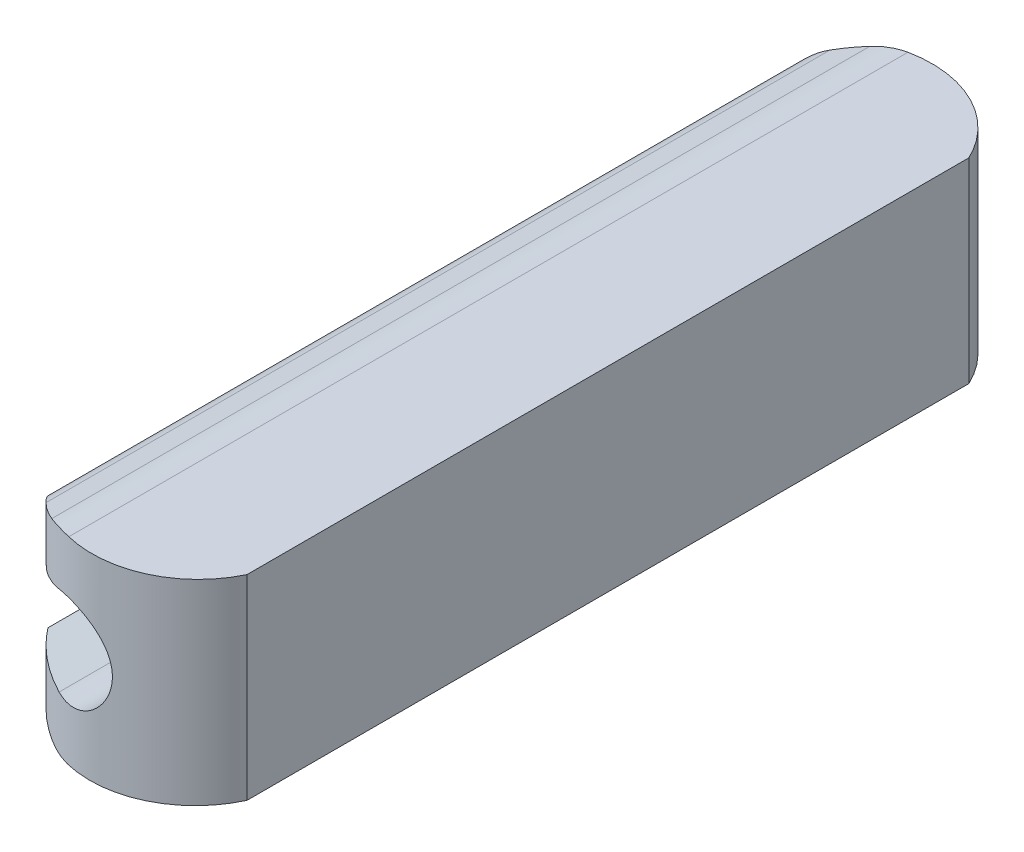
ISO-10303-21;
HEADER;
FILE_DESCRIPTION(('STEP AP214'),'2;1');
FILE_NAME('part.step','',(''),(''),'','','');
FILE_SCHEMA(('AUTOMOTIVE_DESIGN { 1 0 10303 214 1 1 1 1 }'));
ENDSEC;
DATA;
#1=APPLICATION_CONTEXT('core data for automotive mechanical design processes');
#2=APPLICATION_PROTOCOL_DEFINITION('international standard','automotive_design',2000,#1);
#3=PRODUCT_CONTEXT('',#1,'mechanical');
#4=PRODUCT('Part','Part','',(#3));
#5=PRODUCT_RELATED_PRODUCT_CATEGORY('part','',(#4));
#6=PRODUCT_DEFINITION_FORMATION('','',#4);
#7=PRODUCT_DEFINITION_CONTEXT('part definition',#1,'design');
#8=PRODUCT_DEFINITION('design','',#6,#7);
#9=PRODUCT_DEFINITION_SHAPE('','',#8);
#10=(LENGTH_UNIT() NAMED_UNIT(*) SI_UNIT(.MILLI.,.METRE.));
#11=(NAMED_UNIT(*) PLANE_ANGLE_UNIT() SI_UNIT($,.RADIAN.));
#12=(NAMED_UNIT(*) SI_UNIT($,.STERADIAN.) SOLID_ANGLE_UNIT());
#13=UNCERTAINTY_MEASURE_WITH_UNIT(LENGTH_MEASURE(1.E-05),#10,'distance_accuracy_value','');
#14=(GEOMETRIC_REPRESENTATION_CONTEXT(3) GLOBAL_UNCERTAINTY_ASSIGNED_CONTEXT((#13)) GLOBAL_UNIT_ASSIGNED_CONTEXT((#10,
#11,#12)) REPRESENTATION_CONTEXT('',''));
#15=CARTESIAN_POINT('',(0.,0.,0.));
#16=DIRECTION('',(0.,0.,1.));
#17=DIRECTION('',(1.,0.,0.));
#18=AXIS2_PLACEMENT_3D('',#15,#16,#17);
#19=CARTESIAN_POINT('',(-2.45293322950602,-1.69036477014939,16.));
#20=DIRECTION('',(-0.258821432514505,-0.965925186580793,0.));
#21=DIRECTION('',(0.965925186580793,-0.258821432514505,0.));
#22=AXIS2_PLACEMENT_3D('',#19,#20,#21);
#23=PLANE('',#22);
#24=DIRECTION('',(0.,0.,-1.));
#25=VECTOR('',#24,1.);
#26=CARTESIAN_POINT('',(-2.45293322950602,-1.69036477014939,16.));
#27=LINE('',#26,#25);
#28=CARTESIAN_POINT('',(-2.45293322950602,-1.69036477014939,15.7388461950632));
#29=VERTEX_POINT('',#28);
#30=CARTESIAN_POINT('',(-2.45293322950602,-1.69036477014939,-15.7388461950631));
#31=VERTEX_POINT('',#30);
#32=EDGE_CURVE('E177',#29,#31,#27,.T.);
#33=ORIENTED_EDGE('',*,*,#32,.T.);
#34=CARTESIAN_POINT('',(-1.030884728903,-2.07140528461618,-11.9977162722063));
#35=DIRECTION('',(-0.258821432514505,-0.965925186580793,0.));
#36=DIRECTION('',(-0.965925186580793,0.258821432514505,0.));
#37=AXIS2_PLACEMENT_3D('',#34,#35,#36);
#38=ELLIPSE('',#37,4.14347175474436,4.00228372779369);
#39=CARTESIAN_POINT('',(-4.28299140657226,-1.19999731151645,-14.3305422826111));
#40=VERTEX_POINT('',#39);
#41=EDGE_CURVE('E280',#31,#40,#38,.F.);
#42=ORIENTED_EDGE('',*,*,#41,.T.);
#43=DIRECTION('',(0.,0.,-1.));
#44=VECTOR('',#43,1.);
#45=CARTESIAN_POINT('',(-4.28299140657226,-1.19999731151645,16.));
#46=LINE('',#45,#44);
#47=CARTESIAN_POINT('',(-4.28299140657226,-1.19999731151645,14.3305422826111));
#48=VERTEX_POINT('',#47);
#49=EDGE_CURVE('E197',#48,#40,#46,.T.);
#50=ORIENTED_EDGE('',*,*,#49,.F.);
#51=CARTESIAN_POINT('',(-1.030884728903,-2.07140528461618,11.9977162722063));
#52=DIRECTION('',(-0.258821432514505,-0.965925186580793,0.));
#53=DIRECTION('',(-0.965925186580793,0.258821432514505,0.));
#54=AXIS2_PLACEMENT_3D('',#51,#52,#53);
#55=ELLIPSE('',#54,4.14347175474436,4.00228372779369);
#56=EDGE_CURVE('E327',#48,#29,#55,.F.);
#57=ORIENTED_EDGE('',*,*,#56,.T.);
#58=EDGE_LOOP('',(#33,#42,#50,#57));
#59=FACE_BOUND('',#58,.T.);
#60=ADVANCED_FACE('F45',(#59),#23,.F.);
#61=CARTESIAN_POINT('',(-4.80063427160127,-3.13184768467804,16.));
#62=DIRECTION('',(-0.965925186580793,0.258821432514504,0.));
#63=DIRECTION('',(-0.258821432514505,-0.965925186580793,0.));
#64=AXIS2_PLACEMENT_3D('',#61,#62,#63);
#65=PLANE('',#64);
#66=CARTESIAN_POINT('',(-1.030884728903,10.9369100492458,-11.9977162722063));
#67=DIRECTION('',(-0.965925186580793,0.258821432514504,0.));
#68=DIRECTION('',(0.258821432514505,0.965925186580793,0.));
#69=AXIS2_PLACEMENT_3D('',#66,#67,#68);
#70=ELLIPSE('',#69,15.4634942280887,4.00228372779369);
#71=CARTESIAN_POINT('',(-4.54181283908676,-2.16592249809725,-13.9190852744762));
#72=VERTEX_POINT('',#71);
#73=EDGE_CURVE('E278',#72,#40,#70,.F.);
#74=ORIENTED_EDGE('',*,*,#73,.F.);
#75=DIRECTION('',(0.,0.,-1.));
#76=VECTOR('',#75,1.);
#77=CARTESIAN_POINT('',(-4.54181283908676,-2.16592249809725,16.));
#78=LINE('',#77,#76);
#79=CARTESIAN_POINT('',(-4.54181283908676,-2.16592249809725,13.9190852744762));
#80=VERTEX_POINT('',#79);
#81=EDGE_CURVE('E203',#72,#80,#78,.F.);
#82=ORIENTED_EDGE('',*,*,#81,.T.);
#83=CARTESIAN_POINT('',(-1.030884728903,10.9369100492458,11.9977162722063));
#84=DIRECTION('',(-0.965925186580793,0.258821432514504,0.));
#85=DIRECTION('',(0.258821432514505,0.965925186580793,0.));
#86=AXIS2_PLACEMENT_3D('',#83,#84,#85);
#87=ELLIPSE('',#86,15.4634942280887,4.00228372779369);
#88=EDGE_CURVE('E329',#48,#80,#87,.F.);
#89=ORIENTED_EDGE('',*,*,#88,.F.);
#90=ORIENTED_EDGE('',*,*,#49,.T.);
#91=EDGE_LOOP('',(#74,#82,#89,#90));
#92=FACE_BOUND('',#91,.T.);
#93=ADVANCED_FACE('F345',(#92),#65,.T.);
#94=CARTESIAN_POINT('',(-2.97057609453502,-3.62221514331097,16.));
#95=DIRECTION('',(-0.258821432514505,-0.965925186580793,0.));
#96=DIRECTION('',(0.965925186580793,-0.258821432514505,0.));
#97=AXIS2_PLACEMENT_3D('',#94,#95,#96);
#98=PLANE('',#97);
#99=CARTESIAN_POINT('',(-1.030884728903,-4.14195901671178,-11.9977162722063));
#100=DIRECTION('',(-0.258821432514505,-0.965925186580793,0.));
#101=DIRECTION('',(-0.965925186580793,0.258821432514505,0.));
#102=AXIS2_PLACEMENT_3D('',#99,#100,#101);
#103=ELLIPSE('',#102,4.14347175474436,4.00228372779369);
#104=CARTESIAN_POINT('',(-2.97057609453502,-3.62221514331097,-15.49855509224));
#105=VERTEX_POINT('',#104);
#106=CARTESIAN_POINT('',(-3.83470908502047,-3.39066911719254,-14.8537351828238));
#107=VERTEX_POINT('',#106);
#108=EDGE_CURVE('E269',#105,#107,#103,.F.);
#109=ORIENTED_EDGE('',*,*,#108,.F.);
#110=DIRECTION('',(0.,0.,-1.));
#111=VECTOR('',#110,1.);
#112=CARTESIAN_POINT('',(-2.97057609453502,-3.62221514331097,16.));
#113=LINE('',#112,#111);
#114=CARTESIAN_POINT('',(-2.97057609453502,-3.62221514331097,15.49855509224));
#115=VERTEX_POINT('',#114);
#116=EDGE_CURVE('E194',#115,#105,#113,.T.);
#117=ORIENTED_EDGE('',*,*,#116,.F.);
#118=CARTESIAN_POINT('',(-1.030884728903,-4.14195901671178,11.9977162722063));
#119=DIRECTION('',(-0.258821432514505,-0.965925186580793,0.));
#120=DIRECTION('',(-0.965925186580793,0.258821432514505,0.));
#121=AXIS2_PLACEMENT_3D('',#118,#119,#120);
#122=ELLIPSE('',#121,4.14347175474436,4.00228372779369);
#123=CARTESIAN_POINT('',(-3.83470908502047,-3.39066911719254,14.8537351828238));
#124=VERTEX_POINT('',#123);
#125=EDGE_CURVE('E251',#124,#115,#122,.F.);
#126=ORIENTED_EDGE('',*,*,#125,.F.);
#127=DIRECTION('',(0.,0.,-1.));
#128=VECTOR('',#127,1.);
#129=CARTESIAN_POINT('',(-3.83470908502047,-3.39066911719254,16.));
#130=LINE('',#129,#128);
#131=EDGE_CURVE('E200',#124,#107,#130,.T.);
#132=ORIENTED_EDGE('',*,*,#131,.T.);
#133=EDGE_LOOP('',(#109,#117,#126,#132));
#134=FACE_BOUND('',#133,.T.);
#135=ADVANCED_FACE('F298',(#134),#98,.T.);
#136=CARTESIAN_POINT('',(-2.97057609453502,3.62222052027807,16.));
#137=DIRECTION('',(-0.258821432514505,0.965925186580793,0.));
#138=DIRECTION('',(-0.965925186580793,-0.258821432514505,0.));
#139=AXIS2_PLACEMENT_3D('',#136,#137,#138);
#140=PLANE('',#139);
#141=CARTESIAN_POINT('',(-1.030884728903,4.14196439367887,-11.9977162722063));
#142=DIRECTION('',(-0.258821432514505,0.965925186580793,0.));
#143=DIRECTION('',(0.965925186580793,0.258821432514505,0.));
#144=AXIS2_PLACEMENT_3D('',#141,#142,#143);
#145=ELLIPSE('',#144,4.14347175474436,4.00228372779369);
#146=CARTESIAN_POINT('',(-3.83470908502047,3.39067449415964,-14.8537351828238));
#147=VERTEX_POINT('',#146);
#148=CARTESIAN_POINT('',(-2.97057499451313,3.62222081503063,-15.4985557017231));
#149=VERTEX_POINT('',#148);
#150=EDGE_CURVE('E316',#147,#149,#145,.F.);
#151=ORIENTED_EDGE('',*,*,#150,.F.);
#152=DIRECTION('',(0.,0.,-1.));
#153=VECTOR('',#152,1.);
#154=CARTESIAN_POINT('',(-3.83470908502047,3.39067449415964,16.));
#155=LINE('',#154,#153);
#156=CARTESIAN_POINT('',(-3.83470908502047,3.39067449415964,14.8537351828238));
#157=VERTEX_POINT('',#156);
#158=EDGE_CURVE('E209',#147,#157,#155,.F.);
#159=ORIENTED_EDGE('',*,*,#158,.T.);
#160=CARTESIAN_POINT('',(-1.030884728903,4.14196439367887,11.9977162722063));
#161=DIRECTION('',(-0.258821432514505,0.965925186580793,0.));
#162=DIRECTION('',(0.965925186580793,0.258821432514505,0.));
#163=AXIS2_PLACEMENT_3D('',#160,#161,#162);
#164=ELLIPSE('',#163,4.14347175474436,4.00228372779369);
#165=CARTESIAN_POINT('',(-2.97057499451313,3.62222081503063,15.4985557017231));
#166=VERTEX_POINT('',#165);
#167=EDGE_CURVE('E73',#166,#157,#164,.F.);
#168=ORIENTED_EDGE('',*,*,#167,.F.);
#169=DIRECTION('',(0.,0.,-1.));
#170=VECTOR('',#169,1.);
#171=CARTESIAN_POINT('',(-2.97057499451313,3.62222081503063,16.));
#172=LINE('',#171,#170);
#173=EDGE_CURVE('E191',#166,#149,#172,.T.);
#174=ORIENTED_EDGE('',*,*,#173,.T.);
#175=EDGE_LOOP('',(#151,#159,#168,#174));
#176=FACE_BOUND('',#175,.T.);
#177=ADVANCED_FACE('F296',(#176),#140,.T.);
#178=CARTESIAN_POINT('',(-4.28299140657226,1.20000268848355,16.));
#179=DIRECTION('',(-0.965925186580793,-0.258821432514504,0.));
#180=DIRECTION('',(0.258821432514504,-0.965925186580793,0.));
#181=AXIS2_PLACEMENT_3D('',#178,#179,#180);
#182=PLANE('',#181);
#183=CARTESIAN_POINT('',(-1.030884728903,-10.9369046722787,-11.9977162722063));
#184=DIRECTION('',(-0.965925186580793,-0.258821432514504,0.));
#185=DIRECTION('',(-0.258821432514504,0.965925186580793,0.));
#186=AXIS2_PLACEMENT_3D('',#183,#184,#185);
#187=ELLIPSE('',#186,15.4634942280887,4.00228372779369);
#188=CARTESIAN_POINT('',(-4.28299140657226,1.20000268848355,-14.3305422826111));
#189=VERTEX_POINT('',#188);
#190=CARTESIAN_POINT('',(-4.54181283908676,2.16592787506434,-13.9190852744762));
#191=VERTEX_POINT('',#190);
#192=EDGE_CURVE('E65',#189,#191,#187,.F.);
#193=ORIENTED_EDGE('',*,*,#192,.F.);
#194=DIRECTION('',(0.,0.,-1.));
#195=VECTOR('',#194,1.);
#196=CARTESIAN_POINT('',(-4.28299140657226,1.20000268848355,16.));
#197=LINE('',#196,#195);
#198=CARTESIAN_POINT('',(-4.28299140657226,1.20000268848355,14.3305422826111));
#199=VERTEX_POINT('',#198);
#200=EDGE_CURVE('E188',#199,#189,#197,.T.);
#201=ORIENTED_EDGE('',*,*,#200,.F.);
#202=CARTESIAN_POINT('',(-1.030884728903,-10.9369046722787,11.9977162722063));
#203=DIRECTION('',(-0.965925186580793,-0.258821432514504,0.));
#204=DIRECTION('',(-0.258821432514504,0.965925186580793,0.));
#205=AXIS2_PLACEMENT_3D('',#202,#203,#204);
#206=ELLIPSE('',#205,15.4634942280887,4.00228372779369);
#207=CARTESIAN_POINT('',(-4.54181283908676,2.16592787506434,13.9190852744762));
#208=VERTEX_POINT('',#207);
#209=EDGE_CURVE('E353',#208,#199,#206,.F.);
#210=ORIENTED_EDGE('',*,*,#209,.F.);
#211=DIRECTION('',(0.,0.,-1.));
#212=VECTOR('',#211,1.);
#213=CARTESIAN_POINT('',(-4.54181283908676,2.16592787506434,16.));
#214=LINE('',#213,#212);
#215=EDGE_CURVE('E206',#208,#191,#214,.T.);
#216=ORIENTED_EDGE('',*,*,#215,.T.);
#217=EDGE_LOOP('',(#193,#201,#210,#216));
#218=FACE_BOUND('',#217,.T.);
#219=ADVANCED_FACE('F362',(#218),#182,.T.);
#220=CARTESIAN_POINT('',(-2.45293322950602,1.69037014711648,16.));
#221=DIRECTION('',(-0.258821432514505,0.965925186580793,0.));
#222=DIRECTION('',(-0.965925186580793,-0.258821432514505,0.));
#223=AXIS2_PLACEMENT_3D('',#220,#221,#222);
#224=PLANE('',#223);
#225=ORIENTED_EDGE('',*,*,#200,.T.);
#226=CARTESIAN_POINT('',(-1.030884728903,2.07141066158327,-11.9977162722063));
#227=DIRECTION('',(-0.258821432514505,0.965925186580793,0.));
#228=DIRECTION('',(0.965925186580793,0.258821432514505,0.));
#229=AXIS2_PLACEMENT_3D('',#226,#227,#228);
#230=ELLIPSE('',#229,4.14347175474436,4.00228372779369);
#231=CARTESIAN_POINT('',(-2.45293322950602,1.69037014711648,-15.7388461950631));
#232=VERTEX_POINT('',#231);
#233=EDGE_CURVE('E315',#189,#232,#230,.F.);
#234=ORIENTED_EDGE('',*,*,#233,.T.);
#235=DIRECTION('',(0.,0.,-1.));
#236=VECTOR('',#235,1.);
#237=CARTESIAN_POINT('',(-2.45293322950602,1.69037014711648,16.));
#238=LINE('',#237,#236);
#239=CARTESIAN_POINT('',(-2.45293322950602,1.69037014711648,15.7388461950632));
#240=VERTEX_POINT('',#239);
#241=EDGE_CURVE('E185',#240,#232,#238,.T.);
#242=ORIENTED_EDGE('',*,*,#241,.F.);
#243=CARTESIAN_POINT('',(-1.030884728903,2.07141066158327,11.9977162722063));
#244=DIRECTION('',(-0.258821432514505,0.965925186580793,0.));
#245=DIRECTION('',(0.965925186580793,0.258821432514505,0.));
#246=AXIS2_PLACEMENT_3D('',#243,#244,#245);
#247=ELLIPSE('',#246,4.14347175474436,4.00228372779369);
#248=EDGE_CURVE('E252',#240,#199,#247,.F.);
#249=ORIENTED_EDGE('',*,*,#248,.T.);
#250=EDGE_LOOP('',(#225,#234,#242,#249));
#251=FACE_BOUND('',#250,.T.);
#252=ADVANCED_FACE('F361',(#251),#224,.F.);
#253=CARTESIAN_POINT('',(0.,-3.74999536955267,16.));
#254=DIRECTION('',(0.,-1.,0.));
#255=DIRECTION('',(1.,0.,0.));
#256=AXIS2_PLACEMENT_3D('',#253,#254,#255);
#257=PLANE('',#256);
#258=CARTESIAN_POINT('',(-1.030884728903,-3.74999536955275,-11.9977162722063));
#259=DIRECTION('',(0.,-1.,0.));
#260=DIRECTION('',(0.,0.,-1.));
#261=AXIS2_PLACEMENT_3D('',#258,#259,#260);
#262=CIRCLE('',#261,4.00228372779369);
#263=CARTESIAN_POINT('',(-1.99999718774555,-3.74999536955275,-15.8808974526148));
#264=VERTEX_POINT('',#263);
#265=CARTESIAN_POINT('',(2.60276571840215,-3.74999536955275,-13.6754705642769));
#266=VERTEX_POINT('',#265);
#267=EDGE_CURVE('E160',#264,#266,#262,.T.);
#268=ORIENTED_EDGE('',*,*,#267,.T.);
#269=DIRECTION('',(0.,0.,-1.));
#270=VECTOR('',#269,1.);
#271=CARTESIAN_POINT('',(2.60276571840215,-3.74999536955267,16.));
#272=LINE('',#271,#270);
#273=CARTESIAN_POINT('',(2.60276571840215,-3.74999536955275,13.6754705642769));
#274=VERTEX_POINT('',#273);
#275=EDGE_CURVE('E167',#274,#266,#272,.T.);
#276=ORIENTED_EDGE('',*,*,#275,.F.);
#277=CARTESIAN_POINT('',(-1.030884728903,-3.74999536955275,11.9977162722063));
#278=DIRECTION('',(0.,-1.,0.));
#279=DIRECTION('',(0.,0.,1.));
#280=AXIS2_PLACEMENT_3D('',#277,#278,#279);
#281=CIRCLE('',#280,4.00228372779369);
#282=CARTESIAN_POINT('',(-1.99999718774555,-3.74999536955275,15.8808974526148));
#283=VERTEX_POINT('',#282);
#284=EDGE_CURVE('E149',#274,#283,#281,.T.);
#285=ORIENTED_EDGE('',*,*,#284,.T.);
#286=DIRECTION('',(0.,0.,-1.));
#287=VECTOR('',#286,1.);
#288=CARTESIAN_POINT('',(-1.99999718774555,-3.74999536955267,16.));
#289=LINE('',#288,#287);
#290=EDGE_CURVE('E175',#283,#264,#289,.T.);
#291=ORIENTED_EDGE('',*,*,#290,.T.);
#292=EDGE_LOOP('',(#268,#276,#285,#291));
#293=FACE_BOUND('',#292,.T.);
#294=ADVANCED_FACE('F174',(#293),#257,.T.);
#295=CARTESIAN_POINT('',(0.0733858378657422,3.709718651575,16.));
#296=DIRECTION('',(-0.0197781799508234,-0.999804392667802,0.));
#297=DIRECTION('',(0.999804392667802,-0.0197781799508234,0.));
#298=AXIS2_PLACEMENT_3D('',#295,#296,#297);
#299=PLANE('',#298);
#300=DIRECTION('',(0.,0.,-1.));
#301=VECTOR('',#300,1.);
#302=CARTESIAN_POINT('',(2.60276571840215,3.6596823336631,16.));
#303=LINE('',#302,#301);
#304=CARTESIAN_POINT('',(2.60276571840215,3.6596823336631,13.6754705642769));
#305=VERTEX_POINT('',#304);
#306=CARTESIAN_POINT('',(2.60276571840215,3.6596823336631,-13.6754705642769));
#307=VERTEX_POINT('',#306);
#308=EDGE_CURVE('E169',#305,#307,#303,.T.);
#309=ORIENTED_EDGE('',*,*,#308,.T.);
#310=CARTESIAN_POINT('',(-1.030884728903,3.73156338654928,-11.9977162722063));
#311=DIRECTION('',(-0.0197781799508234,-0.999804392667802,0.));
#312=DIRECTION('',(-0.999804392667802,0.0197781799508234,0.));
#313=AXIS2_PLACEMENT_3D('',#310,#311,#312);
#314=ELLIPSE('',#313,4.00306675700264,4.00228372779369);
#315=CARTESIAN_POINT('',(-1.92582905133847,3.74926721940396,-15.8986584273148));
#316=VERTEX_POINT('',#315);
#317=EDGE_CURVE('E320',#307,#316,#314,.F.);
#318=ORIENTED_EDGE('',*,*,#317,.T.);
#319=DIRECTION('',(0.,0.,-1.));
#320=VECTOR('',#319,1.);
#321=CARTESIAN_POINT('',(-1.92582905133847,3.74926721940389,16.));
#322=LINE('',#321,#320);
#323=CARTESIAN_POINT('',(-1.92582905133847,3.74926721940396,15.8986584273148));
#324=VERTEX_POINT('',#323);
#325=EDGE_CURVE('E179',#324,#316,#322,.T.);
#326=ORIENTED_EDGE('',*,*,#325,.F.);
#327=CARTESIAN_POINT('',(-1.030884728903,3.73156338654928,11.9977162722063));
#328=DIRECTION('',(-0.0197781799508234,-0.999804392667802,0.));
#329=DIRECTION('',(-0.999804392667802,0.0197781799508234,0.));
#330=AXIS2_PLACEMENT_3D('',#327,#328,#329);
#331=ELLIPSE('',#330,4.00306675700264,4.00228372779369);
#332=EDGE_CURVE('E171',#324,#305,#331,.F.);
#333=ORIENTED_EDGE('',*,*,#332,.T.);
#334=EDGE_LOOP('',(#309,#318,#326,#333));
#335=FACE_BOUND('',#334,.T.);
#336=ADVANCED_FACE('F221',(#335),#299,.F.);
#337=CARTESIAN_POINT('',(-1.99999718774555,2.68848354670792E-06,16.));
#338=DIRECTION('',(0.,0.,-1.));
#339=DIRECTION('',(-1.,0.,0.));
#340=AXIS2_PLACEMENT_3D('',#337,#338,#339);
#341=CYLINDRICAL_SURFACE('',#340,3.7499980580363);
#342=CARTESIAN_POINT('',(-1.99999718774555,-3.74999536955275,-15.8808974526148));
#343=CARTESIAN_POINT('',(-2.08575228189416,-3.7500113364589,-15.859514687352));
#344=CARTESIAN_POINT('',(-2.17076027349519,-3.74705452271607,-15.8352639264582));
#345=CARTESIAN_POINT('',(-2.33803142329213,-3.73565805022022,-15.781532231521));
#346=CARTESIAN_POINT('',(-2.42031036239841,-3.72725959030275,-15.7520917979917));
#347=CARTESIAN_POINT('',(-2.58216103520052,-3.70543182184758,-15.6881625878047));
#348=CARTESIAN_POINT('',(-2.66173322552486,-3.6920033665075,-15.6536746679155));
#349=CARTESIAN_POINT('',(-2.81834556260527,-3.66049371823136,-15.5797315005388));
#350=CARTESIAN_POINT('',(-2.89536209095974,-3.64237820352151,-15.5402407565357));
#351=CARTESIAN_POINT('',(-2.97057609453506,-3.62221514331112,-15.49855509224));
#352=B_SPLINE_CURVE_WITH_KNOTS('',3,(#342,#343,#344,#345,#346,#347,#348,#349,#350,#351),
.UNSPECIFIED.,.F.,.F.,(4,2,2,2,4),(0.,0.264998894754735,0.528014556403104,0.790985625010632,
1.05593970592983),.UNSPECIFIED.);
#353=EDGE_CURVE('E283',#264,#105,#352,.T.);
#354=ORIENTED_EDGE('',*,*,#353,.F.);
#355=ORIENTED_EDGE('',*,*,#290,.F.);
#356=CARTESIAN_POINT('',(-2.97057609453506,-3.62221514331112,15.49855509224));
#357=CARTESIAN_POINT('',(-2.89536209095974,-3.64237820352151,15.5402407565357));
#358=CARTESIAN_POINT('',(-2.81834556260527,-3.66049371823136,15.5797315005388));
#359=CARTESIAN_POINT('',(-2.66173322552486,-3.6920033665075,15.6536746679155));
#360=CARTESIAN_POINT('',(-2.58216103520052,-3.70543182184758,15.6881625878047));
#361=CARTESIAN_POINT('',(-2.42031036239841,-3.72725959030275,15.7520917979917));
#362=CARTESIAN_POINT('',(-2.33803142329213,-3.73565805022022,15.781532231521));
#363=CARTESIAN_POINT('',(-2.17076027349519,-3.74705452271607,15.8352639264582));
#364=CARTESIAN_POINT('',(-2.08575228189416,-3.7500113364589,15.859514687352));
#365=CARTESIAN_POINT('',(-1.99999718774555,-3.74999536955275,15.8808974526148));
#366=B_SPLINE_CURVE_WITH_KNOTS('',3,(#356,#357,#358,#359,#360,#361,#362,#363,#364,#365),
.UNSPECIFIED.,.F.,.F.,(4,2,2,2,4),(0.,0.2649540809192,0.527925149526728,0.790940811175095,
1.05593970592983),.UNSPECIFIED.);
#367=EDGE_CURVE('E155',#115,#283,#366,.T.);
#368=ORIENTED_EDGE('',*,*,#367,.F.);
#369=ORIENTED_EDGE('',*,*,#116,.T.);
#370=EDGE_LOOP('',(#354,#355,#368,#369));
#371=FACE_BOUND('',#370,.T.);
#372=ADVANCED_FACE('F294',(#371),#341,.T.);
#373=CARTESIAN_POINT('',(-2.97057499451313,3.62222081503063,-15.4985557017231));
#374=CARTESIAN_POINT('',(-2.88988851884182,3.6438536075663,-15.5432778691023));
#375=CARTESIAN_POINT('',(-2.80712000587584,3.66312787703783,-15.5854728629984));
#376=CARTESIAN_POINT('',(-2.63870875349587,3.69619170563301,-15.6640098538193));
#377=CARTESIAN_POINT('',(-2.55309727156406,3.71002750730656,-15.70039956261));
#378=CARTESIAN_POINT('',(-2.37884915037511,3.73184639310836,-15.7673274314034));
#379=CARTESIAN_POINT('',(-2.29021189344988,3.73982827467581,-15.7978643881341));
#380=CARTESIAN_POINT('',(-2.10991819175405,3.74949179532305,-15.8529696045095));
#381=CARTESIAN_POINT('',(-2.01824208222298,3.75111755051414,-15.8774831529747));
#382=CARTESIAN_POINT('',(-1.92582905133847,3.74926721940396,-15.8986584273148));
#383=B_SPLINE_CURVE_WITH_KNOTS('',3,(#373,#374,#375,#376,#377,#378,#379,#380,#381,#382),
.UNSPECIFIED.,.F.,.F.,(4,2,2,2,4),(0.,0.284238888640319,0.566005757874163,0.847830493793274,
1.1321275701048),.UNSPECIFIED.);
#384=EDGE_CURVE('E308',#149,#316,#383,.T.);
#385=ORIENTED_EDGE('',*,*,#384,.F.);
#386=ORIENTED_EDGE('',*,*,#173,.F.);
#387=CARTESIAN_POINT('',(-1.92582905133847,3.74926721940396,15.8986584273148));
#388=CARTESIAN_POINT('',(-2.01824208222298,3.75111755051414,15.8774831529747));
#389=CARTESIAN_POINT('',(-2.10991819175405,3.74949179532305,15.8529696045095));
#390=CARTESIAN_POINT('',(-2.29021189344988,3.73982827467581,15.7978643881341));
#391=CARTESIAN_POINT('',(-2.37884915037511,3.73184639310836,15.7673274314034));
#392=CARTESIAN_POINT('',(-2.55309727156406,3.71002750730656,15.70039956261));
#393=CARTESIAN_POINT('',(-2.63870875349587,3.69619170563301,15.6640098538193));
#394=CARTESIAN_POINT('',(-2.80712000587584,3.66312787703783,15.5854728629984));
#395=CARTESIAN_POINT('',(-2.88988851884182,3.6438536075663,15.5432778691023));
#396=CARTESIAN_POINT('',(-2.97057499451313,3.62222081503063,15.4985557017231));
#397=B_SPLINE_CURVE_WITH_KNOTS('',3,(#387,#388,#389,#390,#391,#392,#393,#394,#395,#396),
.UNSPECIFIED.,.F.,.F.,(4,2,2,2,4),(0.,0.284297076311523,0.566121812230634,0.847888681464477,
1.1321275701048),.UNSPECIFIED.);
#398=EDGE_CURVE('E229',#324,#166,#397,.T.);
#399=ORIENTED_EDGE('',*,*,#398,.F.);
#400=ORIENTED_EDGE('',*,*,#325,.T.);
#401=EDGE_LOOP('',(#385,#386,#399,#400));
#402=FACE_BOUND('',#401,.T.);
#403=ADVANCED_FACE('F288',(#402),#341,.T.);
#404=CARTESIAN_POINT('',(-1.99999718774555,2.68848354670792E-06,16.));
#405=DIRECTION('',(0.,0.,-1.));
#406=DIRECTION('',(-1.,0.,0.));
#407=AXIS2_PLACEMENT_3D('',#404,#405,#406);
#408=CYLINDRICAL_SURFACE('',#407,1.7499980580363);
#409=ORIENTED_EDGE('',*,*,#241,.T.);
#410=CARTESIAN_POINT('',(-2.45293322950602,1.69037014711648,-15.7388461950632));
#411=CARTESIAN_POINT('',(-2.40947616231862,1.70201282000994,-15.7553671266546));
#412=CARTESIAN_POINT('',(-2.36536355892049,1.71203677797308,-15.7712646269125));
#413=CARTESIAN_POINT('',(-2.2760150016433,1.728695142162,-15.8016818256895));
#414=CARTESIAN_POINT('',(-2.2307785291928,1.73532795201225,-15.8162008726907));
#415=CARTESIAN_POINT('',(-2.09370101823686,1.74989982527703,-15.8574791986698));
#416=CARTESIAN_POINT('',(-2.00051740144378,1.75250537836398,-15.8819498933717));
#417=CARTESIAN_POINT('',(-1.81311781534035,1.74253121284984,-15.9239926639164));
#418=CARTESIAN_POINT('',(-1.71889956367207,1.72990513778091,-15.9415434633813));
#419=CARTESIAN_POINT('',(-1.53288096734242,1.68918621441179,-15.9695049035471));
#420=CARTESIAN_POINT('',(-1.4410775858084,1.66111387144292,-15.9799249694275));
#421=CARTESIAN_POINT('',(-1.26702338866354,1.59173688744482,-15.9939391927525));
#422=CARTESIAN_POINT('',(-1.18452726410193,1.55110245627986,-15.9978260804001));
#423=CARTESIAN_POINT('',(-1.02682550366313,1.45734670716957,-16.0007761482736));
#424=CARTESIAN_POINT('',(-0.951624274635816,1.40421790690988,-15.9998364310084));
#425=CARTESIAN_POINT('',(-0.8093174346822,1.28588387022236,-15.9945088315238));
#426=CARTESIAN_POINT('',(-0.742377094321925,1.22048302732012,-15.990060713805));
#427=CARTESIAN_POINT('',(-0.619822109368743,1.07995914401661,-15.9793107326707));
#428=CARTESIAN_POINT('',(-0.564208532775998,1.00483518791455,-15.9730086945859));
#429=CARTESIAN_POINT('',(-0.463299989561277,0.842958002615447,-15.9598926428827));
#430=CARTESIAN_POINT('',(-0.418617858894432,0.755822683641738,-15.9530685141595));
#431=CARTESIAN_POINT('',(-0.344360530747043,0.575235028861775,-15.9408602113655));
#432=CARTESIAN_POINT('',(-0.314785814437687,0.481782491959443,-15.9354760831612));
#433=CARTESIAN_POINT('',(-0.271481859403842,0.290520218339105,-15.9273572231979));
#434=CARTESIAN_POINT('',(-0.257855199772028,0.192686431803869,-15.9246396608478));
#435=CARTESIAN_POINT('',(-0.247237532760858,-0.00390786046223566,-15.9225352203633));
#436=CARTESIAN_POINT('',(-0.250244538671093,-0.10266825411336,-15.9231479444623));
#437=CARTESIAN_POINT('',(-0.272587036157358,-0.296468712118606,-15.9275230174692));
#438=CARTESIAN_POINT('',(-0.291632834130352,-0.391543682049042,-15.9312294767406));
#439=CARTESIAN_POINT('',(-0.345091069667042,-0.57715344819577,-15.9408994141398));
#440=CARTESIAN_POINT('',(-0.379505646312738,-0.66768761045433,-15.9468632064336));
#441=CARTESIAN_POINT('',(-0.463161638354881,-0.842690884943185,-15.9597569896667));
#442=CARTESIAN_POINT('',(-0.512550831000325,-0.927088645029999,-15.9666962227722));
#443=CARTESIAN_POINT('',(-0.624718606213788,-1.08655409532266,-15.9797362500696));
#444=CARTESIAN_POINT('',(-0.687498718270331,-1.16162071819005,-15.9858369483545));
#445=CARTESIAN_POINT('',(-0.825507407565935,-1.30106820188767,-15.9953303305044));
#446=CARTESIAN_POINT('',(-0.900857340781638,-1.36533125796159,-15.998694526125));
#447=CARTESIAN_POINT('',(-1.06134968722476,-1.48025566648844,-16.0006862627049));
#448=CARTESIAN_POINT('',(-1.14648818432012,-1.53092243157742,-15.999315691582));
#449=CARTESIAN_POINT('',(-1.32048475473683,-1.61547199134618,-15.9904224391499));
#450=CARTESIAN_POINT('',(-1.40908286875975,-1.64991389652562,-15.9831328527929));
#451=CARTESIAN_POINT('',(-1.58994085667921,-1.70388909480428,-15.9618062545628));
#452=CARTESIAN_POINT('',(-1.68220054035809,-1.72342316129841,-15.9477695927787));
#453=CARTESIAN_POINT('',(-1.86393903653007,-1.74701801403,-15.9133959897707));
#454=CARTESIAN_POINT('',(-1.95339692442204,-1.75161581687856,-15.8933068053384));
#455=CARTESIAN_POINT('',(-2.13035736984316,-1.74737253413396,-15.8471033048749));
#456=CARTESIAN_POINT('',(-2.21786151655,-1.73854280706467,-15.8209940971067));
#457=CARTESIAN_POINT('',(-2.32863736267034,-1.71905365699092,-15.7838535686245));
#458=CARTESIAN_POINT('',(-2.35379848975327,-1.71404924090396,-15.7751334935713));
#459=CARTESIAN_POINT('',(-2.40368466651899,-1.70298848562102,-15.7572896852942));
#460=CARTESIAN_POINT('',(-2.42841048656521,-1.69693426662493,-15.7481667927681));
#461=CARTESIAN_POINT('',(-2.45293322950602,-1.69036477014939,-15.7388461950632));
#462=B_SPLINE_CURVE_WITH_KNOTS('',3,(#410,#411,#412,#413,#414,#415,#416,#417,#418,#419,#420,
#421,#422,#423,#424,#425,#426,#427,#428,#429,#430,#431,#432,#433,#434,#435,#436,#437,#438,#439,
#440,#441,#442,#443,#444,#445,#446,#447,#448,#449,#450,#451,#452,#453,#454,#455,#456,#457,#458,
#459,#460,#461),.UNSPECIFIED.,.F.,.F.,(4,2,2,2,2,2,2,2,2,2,2,2,2,2,2,2,2,2,2,2,2,2,2,2,2,4),(0.,
0.143712592153762,0.287492774547497,0.575136716602164,0.86365829722031,1.15179777865198,
1.42664417191469,1.70165557931599,1.98149421316661,2.26135922078915,2.55446798639053,
2.84758608692487,3.14257936020235,3.43753740050311,3.72727939743435,4.01706173427569,
4.30980239469529,4.60257650938761,4.89836087350379,5.19402731162061,5.47858435137858,
5.76312662776698,6.03731822610923,6.31127801116375,6.39254792175318,6.47365557031361),.UNSPECIFIED.);
#463=EDGE_CURVE('E271',#232,#31,#462,.T.);
#464=ORIENTED_EDGE('',*,*,#463,.T.);
#465=ORIENTED_EDGE('',*,*,#32,.F.);
#466=CARTESIAN_POINT('',(-2.45293322950602,-1.69036477014939,15.7388461950632));
#467=CARTESIAN_POINT('',(-2.40947616231862,-1.70200744304284,15.7553671266546));
#468=CARTESIAN_POINT('',(-2.36536355892049,-1.71203140100599,15.7712646269125));
#469=CARTESIAN_POINT('',(-2.2760150016433,-1.72868976519491,15.8016818256895));
#470=CARTESIAN_POINT('',(-2.2307785291928,-1.73532257504515,15.8162008726907));
#471=CARTESIAN_POINT('',(-2.09370101823686,-1.74989444830994,15.8574791986698));
#472=CARTESIAN_POINT('',(-2.00051740144378,-1.75250000139688,15.8819498933717));
#473=CARTESIAN_POINT('',(-1.81311781534035,-1.74252583588274,15.9239926639164));
#474=CARTESIAN_POINT('',(-1.71889956367207,-1.72989976081382,15.9415434633813));
#475=CARTESIAN_POINT('',(-1.53288096734242,-1.6891808374447,15.9695049035471));
#476=CARTESIAN_POINT('',(-1.4410775858084,-1.66110849447583,15.9799249694275));
#477=CARTESIAN_POINT('',(-1.26702338866354,-1.59173151047772,15.9939391927525));
#478=CARTESIAN_POINT('',(-1.18452726410193,-1.55109707931277,15.9978260804001));
#479=CARTESIAN_POINT('',(-1.02682550366313,-1.45734133020248,16.0007761482736));
#480=CARTESIAN_POINT('',(-0.951624274635816,-1.40421252994278,15.9998364310084));
#481=CARTESIAN_POINT('',(-0.8093174346822,-1.28587849325526,15.9945088315238));
#482=CARTESIAN_POINT('',(-0.742377094321925,-1.22047765035303,15.990060713805));
#483=CARTESIAN_POINT('',(-0.619822109368743,-1.07995376704952,15.9793107326707));
#484=CARTESIAN_POINT('',(-0.564208532775998,-1.00482981094746,15.9730086945859));
#485=CARTESIAN_POINT('',(-0.463299989561277,-0.842952625648354,15.9598926428827));
#486=CARTESIAN_POINT('',(-0.418617858894432,-0.755817306674645,15.9530685141595));
#487=CARTESIAN_POINT('',(-0.344360530747043,-0.575229651894682,15.9408602113655));
#488=CARTESIAN_POINT('',(-0.314785814437687,-0.48177711499235,15.9354760831612));
#489=CARTESIAN_POINT('',(-0.271481859403842,-0.290514841372012,15.9273572231979));
#490=CARTESIAN_POINT('',(-0.257855199772028,-0.192681054836776,15.9246396608478));
#491=CARTESIAN_POINT('',(-0.247237532760858,0.00391323742932901,15.9225352203633));
#492=CARTESIAN_POINT('',(-0.250244538671093,0.102673631080454,15.9231479444623));
#493=CARTESIAN_POINT('',(-0.272587036157358,0.296474089085699,15.9275230174692));
#494=CARTESIAN_POINT('',(-0.291632834130352,0.391549059016136,15.9312294767406));
#495=CARTESIAN_POINT('',(-0.345091069667042,0.577158825162863,15.9408994141398));
#496=CARTESIAN_POINT('',(-0.379505646312738,0.667692987421423,15.9468632064336));
#497=CARTESIAN_POINT('',(-0.463161638354881,0.842696261910278,15.9597569896667));
#498=CARTESIAN_POINT('',(-0.512550831000325,0.927094021997092,15.9666962227722));
#499=CARTESIAN_POINT('',(-0.624718606213789,1.08655947228976,15.9797362500696));
#500=CARTESIAN_POINT('',(-0.687498718270331,1.16162609515715,15.9858369483545));
#501=CARTESIAN_POINT('',(-0.825507407565936,1.30107357885476,15.9953303305044));
#502=CARTESIAN_POINT('',(-0.900857340781639,1.36533663492869,15.998694526125));
#503=CARTESIAN_POINT('',(-1.06134968722476,1.48026104345554,16.0006862627049));
#504=CARTESIAN_POINT('',(-1.14648818432012,1.53092780854451,15.999315691582));
#505=CARTESIAN_POINT('',(-1.32048475473683,1.61547736831328,15.9904224391499));
#506=CARTESIAN_POINT('',(-1.40908286875975,1.64991927349272,15.9831328527929));
#507=CARTESIAN_POINT('',(-1.58994085667921,1.70389447177137,15.9618062545628));
#508=CARTESIAN_POINT('',(-1.68220054035809,1.72342853826551,15.9477695927787));
#509=CARTESIAN_POINT('',(-1.86393903653007,1.74702339099709,15.9133959897707));
#510=CARTESIAN_POINT('',(-1.95339692442204,1.75162119384566,15.8933068053384));
#511=CARTESIAN_POINT('',(-2.13035736984317,1.74737791110106,15.8471033048749));
#512=CARTESIAN_POINT('',(-2.21786151655001,1.73854818403176,15.8209940971067));
#513=CARTESIAN_POINT('',(-2.32863736267034,1.71905903395801,15.7838535686245));
#514=CARTESIAN_POINT('',(-2.35379848975327,1.71405461787105,15.7751334935713));
#515=CARTESIAN_POINT('',(-2.40368466651898,1.70299386258811,15.7572896852942));
#516=CARTESIAN_POINT('',(-2.42841048656521,1.69693964359203,15.7481667927681));
#517=CARTESIAN_POINT('',(-2.45293322950602,1.69037014711648,15.7388461950632));
#518=B_SPLINE_CURVE_WITH_KNOTS('',3,(#466,#467,#468,#469,#470,#471,#472,#473,#474,#475,#476,
#477,#478,#479,#480,#481,#482,#483,#484,#485,#486,#487,#488,#489,#490,#491,#492,#493,#494,#495,
#496,#497,#498,#499,#500,#501,#502,#503,#504,#505,#506,#507,#508,#509,#510,#511,#512,#513,#514,
#515,#516,#517),.UNSPECIFIED.,.F.,.F.,(4,2,2,2,2,2,2,2,2,2,2,2,2,2,2,2,2,2,2,2,2,2,2,2,2,4),(0.,
0.143712592153762,0.287492774547497,0.575136716602164,0.86365829722031,1.15179777865198,
1.42664417191469,1.70165557931599,1.98149421316661,2.26135922078915,2.55446798639053,
2.84758608692487,3.14257936020235,3.43753740050311,3.72727939743435,4.01706173427569,
4.30980239469529,4.60257650938761,4.89836087350379,5.19402731162061,5.47858435137858,
5.76312662776698,6.03731822610923,6.31127801116375,6.39254792175318,6.47365557031361),.UNSPECIFIED.);
#519=EDGE_CURVE('E170',#29,#240,#518,.T.);
#520=ORIENTED_EDGE('',*,*,#519,.T.);
#521=EDGE_LOOP('',(#409,#464,#465,#520));
#522=FACE_BOUND('',#521,.T.);
#523=ADVANCED_FACE('F293',(#522),#408,.F.);
#524=CARTESIAN_POINT('',(2.60276571840215,0.,16.));
#525=DIRECTION('',(1.,0.,0.));
#526=DIRECTION('',(0.,1.,0.));
#527=AXIS2_PLACEMENT_3D('',#524,#525,#526);
#528=PLANE('',#527);
#529=DIRECTION('',(0.,1.,0.));
#530=VECTOR('',#529,1.);
#531=CARTESIAN_POINT('',(2.60276571840215,-3.74999536955275,-13.6754705642769));
#532=LINE('',#531,#530);
#533=EDGE_CURVE('E270',#307,#266,#532,.F.);
#534=ORIENTED_EDGE('',*,*,#533,.F.);
#535=ORIENTED_EDGE('',*,*,#308,.F.);
#536=DIRECTION('',(0.,1.,0.));
#537=VECTOR('',#536,1.);
#538=CARTESIAN_POINT('',(2.60276571840215,-3.74999536955275,13.6754705642769));
#539=LINE('',#538,#537);
#540=EDGE_CURVE('E152',#274,#305,#539,.T.);
#541=ORIENTED_EDGE('',*,*,#540,.F.);
#542=ORIENTED_EDGE('',*,*,#275,.T.);
#543=EDGE_LOOP('',(#534,#535,#541,#542));
#544=FACE_BOUND('',#543,.T.);
#545=ADVANCED_FACE('F166',(#544),#528,.T.);
#546=CARTESIAN_POINT('',(-3.57588765250597,-2.42474393061175,16.));
#547=DIRECTION('',(0.,0.,-1.));
#548=DIRECTION('',(-1.,0.,0.));
#549=AXIS2_PLACEMENT_3D('',#546,#547,#548);
#550=CYLINDRICAL_SURFACE('',#549,1.);
#551=CARTESIAN_POINT('',(-3.83470908502047,-3.39066911719254,-14.8537351828238));
#552=CARTESIAN_POINT('',(-3.87324934150154,-3.38032468815994,-14.815908591221));
#553=CARTESIAN_POINT('',(-3.91070469577678,-3.36783364972672,-14.7775969733751));
#554=CARTESIAN_POINT('',(-3.98333267013337,-3.33881522630596,-14.700330550147));
#555=CARTESIAN_POINT('',(-4.0185050232127,-3.32228737027644,-14.6613756701998));
#556=CARTESIAN_POINT('',(-4.08678673423074,-3.28526946031727,-14.5827651608234));
#557=CARTESIAN_POINT('',(-4.11987178017498,-3.26474122106541,-14.5431064241895));
#558=CARTESIAN_POINT('',(-4.18348148329437,-3.21994332930272,-14.4638859322796));
#559=CARTESIAN_POINT('',(-4.21400676395604,-3.19567459198259,-14.4243241556794));
#560=CARTESIAN_POINT('',(-4.28442819355651,-3.13258772330685,-14.3295563770695));
#561=CARTESIAN_POINT('',(-4.32302560846017,-3.09188716306052,-14.2745967589327));
#562=CARTESIAN_POINT('',(-4.37646994953507,-3.02464369082964,-14.1946159772542));
#563=CARTESIAN_POINT('',(-4.39352207632894,-3.00123402923111,-14.1684003398832));
#564=CARTESIAN_POINT('',(-4.42603739214201,-2.95210888804791,-14.1171807252386));
#565=CARTESIAN_POINT('',(-4.44150155688636,-2.92639484280781,-14.0921760089652));
#566=CARTESIAN_POINT('',(-4.47126124690461,-2.87120948571042,-14.0429415146412));
#567=CARTESIAN_POINT('',(-4.48547874922978,-2.84162466893188,-14.0187903312425));
#568=CARTESIAN_POINT('',(-4.51156289616501,-2.7792205253714,-13.9735284811748));
#569=CARTESIAN_POINT('',(-4.52343143333735,-2.74640383470388,-13.9524153705041));
#570=CARTESIAN_POINT('',(-4.5419794128597,-2.68451076075961,-13.9188559849641));
#571=CARTESIAN_POINT('',(-4.54922516605707,-2.6560962974667,-13.9055207661293));
#572=CARTESIAN_POINT('',(-4.5613610102017,-2.59719843591064,-13.8829689903226));
#573=CARTESIAN_POINT('',(-4.56625573455276,-2.56671924328377,-13.8737443348752));
#574=CARTESIAN_POINT('',(-4.57262887410388,-2.5095379295182,-13.8616805226067));
#575=CARTESIAN_POINT('',(-4.57454229349812,-2.48305864311066,-13.8580304184831));
#576=CARTESIAN_POINT('',(-4.57622917315946,-2.42978809453073,-13.8548139498732));
#577=CARTESIAN_POINT('',(-4.57600381586465,-2.40299701291881,-13.8552453289091));
#578=CARTESIAN_POINT('',(-4.5734404893096,-2.34995813859257,-13.8601288027897));
#579=CARTESIAN_POINT('',(-4.57110703561292,-2.32370930724235,-13.8645723036181));
#580=CARTESIAN_POINT('',(-4.56454116655992,-2.27230600867859,-13.8769701784106));
#581=CARTESIAN_POINT('',(-4.56030665646251,-2.24715278232402,-13.8849284250547));
#582=CARTESIAN_POINT('',(-4.55126540129416,-2.20330906631486,-13.901729323208));
#583=CARTESIAN_POINT('',(-4.54675721751354,-2.18435631706525,-13.9100503007432));
#584=CARTESIAN_POINT('',(-4.5418128390869,-2.16592249809721,-13.9190852744762));
#585=B_SPLINE_CURVE_WITH_KNOTS('',3,(#551,#552,#553,#554,#555,#556,#557,#558,#559,#560,#561,
#562,#563,#564,#565,#566,#567,#568,#569,#570,#571,#572,#573,#574,#575,#576,#577,#578,#579,#580,
#581,#582,#583,#584),.UNSPECIFIED.,.F.,.F.,(4,2,2,2,2,2,2,2,2,2,2,2,2,2,2,2,4),(0.,
0.164862042336457,0.32974333104031,0.496283247824178,0.662782481646624,0.897647185985264,
1.01475341834371,1.13178725856819,1.25381498217986,1.37574398413156,1.47206585029152,
1.56819709855125,1.6482209496869,1.72820056163823,1.80800926160026,1.8879061180496,
1.95131027321119),.UNSPECIFIED.);
#586=EDGE_CURVE('E262',#107,#72,#585,.T.);
#587=ORIENTED_EDGE('',*,*,#586,.F.);
#588=ORIENTED_EDGE('',*,*,#131,.F.);
#589=CARTESIAN_POINT('',(-4.54181283908676,-2.16592249809725,13.9190852744762));
#590=CARTESIAN_POINT('',(-4.54898235722352,-2.19258211198102,13.905979927926));
#591=CARTESIAN_POINT('',(-4.55522711892668,-2.22040243497243,13.8943967521827));
#592=CARTESIAN_POINT('',(-4.56546985688779,-2.27787697471151,13.8752433242487));
#593=CARTESIAN_POINT('',(-4.56945959780802,-2.30753747992855,13.8676877866317));
#594=CARTESIAN_POINT('',(-4.57476178450175,-2.36828783205234,13.8576207503409));
#595=CARTESIAN_POINT('',(-4.57604863309006,-2.39938851867292,13.8551574803593));
#596=CARTESIAN_POINT('',(-4.5756947542144,-2.4613990185197,13.8558328725763));
#597=CARTESIAN_POINT('',(-4.57406404769733,-2.49230912058741,13.8589523596507));
#598=CARTESIAN_POINT('',(-4.56854422124537,-2.54849551214042,13.8694178772453));
#599=CARTESIAN_POINT('',(-4.56501514432571,-2.57394089615694,13.8760886889839));
#600=CARTESIAN_POINT('',(-4.55625222991038,-2.6235426453916,13.8924843692427));
#601=CARTESIAN_POINT('',(-4.55101533610545,-2.64769660860646,13.9022147119733));
#602=CARTESIAN_POINT('',(-4.53468406684536,-2.7119515013792,13.9321744252194));
#603=CARTESIAN_POINT('',(-4.52213110348095,-2.7505410069845,13.9548278068591));
#604=CARTESIAN_POINT('',(-4.49379918198974,-2.82346480268927,14.0045355355025));
#605=CARTESIAN_POINT('',(-4.47800974697392,-2.85778467652212,14.0316041154527));
#606=CARTESIAN_POINT('',(-4.44541012313211,-2.91975879937688,14.0858258050277));
#607=CARTESIAN_POINT('',(-4.42882172329391,-2.94773520976342,14.1127494488969));
#608=CARTESIAN_POINT('',(-4.39378291048029,-3.00099300548298,14.1680311426798));
#609=CARTESIAN_POINT('',(-4.37533098810283,-3.02627217148676,14.1963903459332));
#610=CARTESIAN_POINT('',(-4.31739406816219,-3.09853593445929,14.2828701306351));
#611=CARTESIAN_POINT('',(-4.2753586348164,-3.1418909839688,14.342340724259));
#612=CARTESIAN_POINT('',(-4.18122660684936,-3.22334673240042,14.4675991080266));
#613=CARTESIAN_POINT('',(-4.12856852195724,-3.26064132341014,14.5334796826433));
#614=CARTESIAN_POINT('',(-4.01657567593464,-3.32470895114968,14.6644188266017));
#615=CARTESIAN_POINT('',(-3.95726063382601,-3.35151205950389,14.7294792202619));
#616=CARTESIAN_POINT('',(-3.87513490816312,-3.37914483453195,14.8136228469488));
#617=CARTESIAN_POINT('',(-3.85506962193941,-3.38520908013739,14.83375075702));
#618=CARTESIAN_POINT('',(-3.83470908502047,-3.39066911719254,14.8537351828238));
#619=B_SPLINE_CURVE_WITH_KNOTS('',3,(#589,#590,#591,#592,#593,#594,#595,#596,#597,#598,#599,
#600,#601,#602,#603,#604,#605,#606,#607,#608,#609,#610,#611,#612,#613,#614,#615,#616,#617,#618),
.UNSPECIFIED.,.F.,.F.,(4,2,2,2,2,2,2,2,2,2,2,2,2,2,4),(0.,0.0918291267580599,0.183991481868963,
0.277022777471812,0.369735151013424,0.449062382768746,0.52853236483717,0.667151371254757,
0.806226400723231,0.932711864913158,1.05930061326236,1.31272256686349,1.58860234879169,
1.86368548539807,1.95083705284292),.UNSPECIFIED.);
#620=EDGE_CURVE('E245',#80,#124,#619,.T.);
#621=ORIENTED_EDGE('',*,*,#620,.F.);
#622=ORIENTED_EDGE('',*,*,#81,.F.);
#623=EDGE_LOOP('',(#587,#588,#621,#622));
#624=FACE_BOUND('',#623,.T.);
#625=ADVANCED_FACE('F254',(#624),#550,.T.);
#626=CARTESIAN_POINT('',(-3.57588765250597,2.42474930757884,16.));
#627=DIRECTION('',(0.,0.,-1.));
#628=DIRECTION('',(-1.,0.,0.));
#629=AXIS2_PLACEMENT_3D('',#626,#627,#628);
#630=CYLINDRICAL_SURFACE('',#629,1.);
#631=CARTESIAN_POINT('',(-4.54181283908676,2.16592787506434,-13.9190852744762));
#632=CARTESIAN_POINT('',(-4.54898235722352,2.19258748894811,-13.905979927926));
#633=CARTESIAN_POINT('',(-4.55522711892668,2.22040781193952,-13.8943967521827));
#634=CARTESIAN_POINT('',(-4.56546985688779,2.2778823516786,-13.8752433242487));
#635=CARTESIAN_POINT('',(-4.56945959780802,2.30754285689565,-13.8676877866317));
#636=CARTESIAN_POINT('',(-4.57476178450175,2.36829320901944,-13.8576207503409));
#637=CARTESIAN_POINT('',(-4.57604863309006,2.39939389564002,-13.8551574803593));
#638=CARTESIAN_POINT('',(-4.5756947542144,2.46140439548679,-13.8558328725763));
#639=CARTESIAN_POINT('',(-4.57406404769733,2.49231449755451,-13.8589523596507));
#640=CARTESIAN_POINT('',(-4.56854422124537,2.54850088910751,-13.8694178772453));
#641=CARTESIAN_POINT('',(-4.56501514432571,2.57394627312403,-13.8760886889839));
#642=CARTESIAN_POINT('',(-4.55625222991038,2.62354802235869,-13.8924843692427));
#643=CARTESIAN_POINT('',(-4.55101533610545,2.64770198557356,-13.9022147119733));
#644=CARTESIAN_POINT('',(-4.53468406684536,2.71195687834629,-13.9321744252194));
#645=CARTESIAN_POINT('',(-4.52213110348095,2.7505463839516,-13.9548278068592));
#646=CARTESIAN_POINT('',(-4.49379918198974,2.82347017965636,-14.0045355355025));
#647=CARTESIAN_POINT('',(-4.47800974697392,2.85779005348922,-14.0316041154527));
#648=CARTESIAN_POINT('',(-4.44541012313211,2.91976417634397,-14.0858258050277));
#649=CARTESIAN_POINT('',(-4.42882172329391,2.94774058673051,-14.1127494488969));
#650=CARTESIAN_POINT('',(-4.39378291048028,3.00099838245008,-14.1680311426798));
#651=CARTESIAN_POINT('',(-4.37533098810283,3.02627754845386,-14.1963903459332));
#652=CARTESIAN_POINT('',(-4.31739406816218,3.09854131142639,-14.2828701306351));
#653=CARTESIAN_POINT('',(-4.2753586348164,3.1418963609359,-14.342340724259));
#654=CARTESIAN_POINT('',(-4.18122660684936,3.22335210936751,-14.4675991080266));
#655=CARTESIAN_POINT('',(-4.12856852195723,3.26064670037723,-14.5334796826433));
#656=CARTESIAN_POINT('',(-4.01657567593464,3.32471432811678,-14.6644188266017));
#657=CARTESIAN_POINT('',(-3.957260633826,3.35151743647099,-14.7294792202619));
#658=CARTESIAN_POINT('',(-3.87513490816312,3.37915021149905,-14.8136228469488));
#659=CARTESIAN_POINT('',(-3.8550696219394,3.38521445710449,-14.83375075702));
#660=CARTESIAN_POINT('',(-3.83470908502048,3.39067449415964,-14.8537351828238));
#661=B_SPLINE_CURVE_WITH_KNOTS('',3,(#631,#632,#633,#634,#635,#636,#637,#638,#639,#640,#641,
#642,#643,#644,#645,#646,#647,#648,#649,#650,#651,#652,#653,#654,#655,#656,#657,#658,#659,#660),
.UNSPECIFIED.,.F.,.F.,(4,2,2,2,2,2,2,2,2,2,2,2,2,2,4),(0.,0.0918291267580607,0.183991481868964,
0.277022777471813,0.369735151013425,0.449062382768747,0.528532364837171,0.667151371254759,
0.806226400723234,0.93271186491316,1.05930061326237,1.31272256686349,1.5886023487917,
1.86368548539808,1.95083705284292),.UNSPECIFIED.);
#662=EDGE_CURVE('E11',#191,#147,#661,.T.);
#663=ORIENTED_EDGE('',*,*,#662,.F.);
#664=ORIENTED_EDGE('',*,*,#215,.F.);
#665=CARTESIAN_POINT('',(-3.83470908502047,3.39067449415964,14.8537351828238));
#666=CARTESIAN_POINT('',(-3.87324934150154,3.38033006512703,14.815908591221));
#667=CARTESIAN_POINT('',(-3.91070469577678,3.36783902669382,14.7775969733751));
#668=CARTESIAN_POINT('',(-3.98333267013337,3.33882060327306,14.700330550147));
#669=CARTESIAN_POINT('',(-4.0185050232127,3.32229274724353,14.6613756701998));
#670=CARTESIAN_POINT('',(-4.08678673423074,3.28527483728436,14.5827651608234));
#671=CARTESIAN_POINT('',(-4.11987178017498,3.26474659803251,14.5431064241895));
#672=CARTESIAN_POINT('',(-4.18348148329437,3.21994870626981,14.4638859322796));
#673=CARTESIAN_POINT('',(-4.21400676395605,3.19567996894968,14.4243241556794));
#674=CARTESIAN_POINT('',(-4.28442819355651,3.13259310027395,14.3295563770695));
#675=CARTESIAN_POINT('',(-4.32302560846017,3.09189254002761,14.2745967589327));
#676=CARTESIAN_POINT('',(-4.37646994953507,3.02464906779673,14.1946159772542));
#677=CARTESIAN_POINT('',(-4.39352207632894,3.00123940619821,14.1684003398832));
#678=CARTESIAN_POINT('',(-4.42603739214201,2.952114265015,14.1171807252386));
#679=CARTESIAN_POINT('',(-4.44150155688636,2.9264002197749,14.0921760089652));
#680=CARTESIAN_POINT('',(-4.47126124690461,2.87121486267751,14.0429415146412));
#681=CARTESIAN_POINT('',(-4.48547874922978,2.84163004589898,14.0187903312425));
#682=CARTESIAN_POINT('',(-4.51156289616501,2.77922590233849,13.9735284811748));
#683=CARTESIAN_POINT('',(-4.52343143333735,2.74640921167097,13.9524153705041));
#684=CARTESIAN_POINT('',(-4.5419794128597,2.68451613772671,13.9188559849641));
#685=CARTESIAN_POINT('',(-4.54922516605707,2.6561016744338,13.9055207661293));
#686=CARTESIAN_POINT('',(-4.5613610102017,2.59720381287773,13.8829689903226));
#687=CARTESIAN_POINT('',(-4.56625573455276,2.56672462025087,13.8737443348752));
#688=CARTESIAN_POINT('',(-4.57262887410388,2.50954330648529,13.8616805226067));
#689=CARTESIAN_POINT('',(-4.57454229349812,2.48306402007775,13.8580304184831));
#690=CARTESIAN_POINT('',(-4.57622917315946,2.42979347149782,13.8548139498732));
#691=CARTESIAN_POINT('',(-4.57600381586465,2.4030023898859,13.8552453289091));
#692=CARTESIAN_POINT('',(-4.5734404893096,2.34996351555966,13.8601288027897));
#693=CARTESIAN_POINT('',(-4.57110703561292,2.32371468420945,13.8645723036181));
#694=CARTESIAN_POINT('',(-4.56454116655992,2.27231138564568,13.8769701784106));
#695=CARTESIAN_POINT('',(-4.56030665646251,2.24715815929111,13.8849284250547));
#696=CARTESIAN_POINT('',(-4.55126540129416,2.20331444328196,13.901729323208));
#697=CARTESIAN_POINT('',(-4.54675721751354,2.18436169403234,13.9100503007432));
#698=CARTESIAN_POINT('',(-4.5418128390869,2.16592787506431,13.9190852744762));
#699=B_SPLINE_CURVE_WITH_KNOTS('',3,(#665,#666,#667,#668,#669,#670,#671,#672,#673,#674,#675,
#676,#677,#678,#679,#680,#681,#682,#683,#684,#685,#686,#687,#688,#689,#690,#691,#692,#693,#694,
#695,#696,#697,#698),.UNSPECIFIED.,.F.,.F.,(4,2,2,2,2,2,2,2,2,2,2,2,2,2,2,2,4),(0.,
0.164862042336457,0.329743331040311,0.49628324782418,0.662782481646627,0.897647185985264,
1.01475341834372,1.13178725856819,1.25381498217986,1.37574398413156,1.47206585029152,
1.56819709855126,1.6482209496869,1.72820056163824,1.80800926160027,1.8879061180496,
1.95131027321119),.UNSPECIFIED.);
#700=EDGE_CURVE('E59',#157,#208,#699,.T.);
#701=ORIENTED_EDGE('',*,*,#700,.F.);
#702=ORIENTED_EDGE('',*,*,#158,.F.);
#703=EDGE_LOOP('',(#663,#664,#701,#702));
#704=FACE_BOUND('',#703,.T.);
#705=ADVANCED_FACE('F47',(#704),#630,.T.);
#706=CARTESIAN_POINT('',(-1.030884728903,-3.74999536955275,11.9977162722063));
#707=DIRECTION('',(0.,1.,0.));
#708=DIRECTION('',(0.,0.,1.));
#709=AXIS2_PLACEMENT_3D('',#706,#707,#708);
#710=CYLINDRICAL_SURFACE('',#709,4.00228372779369);
#711=ORIENTED_EDGE('',*,*,#519,.F.);
#712=ORIENTED_EDGE('',*,*,#56,.F.);
#713=ORIENTED_EDGE('',*,*,#88,.T.);
#714=ORIENTED_EDGE('',*,*,#620,.T.);
#715=ORIENTED_EDGE('',*,*,#125,.T.);
#716=ORIENTED_EDGE('',*,*,#367,.T.);
#717=ORIENTED_EDGE('',*,*,#284,.F.);
#718=ORIENTED_EDGE('',*,*,#540,.T.);
#719=ORIENTED_EDGE('',*,*,#332,.F.);
#720=ORIENTED_EDGE('',*,*,#398,.T.);
#721=ORIENTED_EDGE('',*,*,#167,.T.);
#722=ORIENTED_EDGE('',*,*,#700,.T.);
#723=ORIENTED_EDGE('',*,*,#209,.T.);
#724=ORIENTED_EDGE('',*,*,#248,.F.);
#725=EDGE_LOOP('',(#711,#712,#713,#714,#715,#716,#717,#718,#719,#720,#721,#722,#723,#724));
#726=FACE_BOUND('',#725,.T.);
#727=ADVANCED_FACE('F151',(#726),#710,.T.);
#728=CARTESIAN_POINT('',(-1.030884728903,-3.74999536955275,-11.9977162722063));
#729=DIRECTION('',(0.,1.,0.));
#730=DIRECTION('',(0.,0.,1.));
#731=AXIS2_PLACEMENT_3D('',#728,#729,#730);
#732=CYLINDRICAL_SURFACE('',#731,4.00228372779369);
#733=ORIENTED_EDGE('',*,*,#463,.F.);
#734=ORIENTED_EDGE('',*,*,#233,.F.);
#735=ORIENTED_EDGE('',*,*,#192,.T.);
#736=ORIENTED_EDGE('',*,*,#662,.T.);
#737=ORIENTED_EDGE('',*,*,#150,.T.);
#738=ORIENTED_EDGE('',*,*,#384,.T.);
#739=ORIENTED_EDGE('',*,*,#317,.F.);
#740=ORIENTED_EDGE('',*,*,#533,.T.);
#741=ORIENTED_EDGE('',*,*,#267,.F.);
#742=ORIENTED_EDGE('',*,*,#353,.T.);
#743=ORIENTED_EDGE('',*,*,#108,.T.);
#744=ORIENTED_EDGE('',*,*,#586,.T.);
#745=ORIENTED_EDGE('',*,*,#73,.T.);
#746=ORIENTED_EDGE('',*,*,#41,.F.);
#747=EDGE_LOOP('',(#733,#734,#735,#736,#737,#738,#739,#740,#741,#742,#743,#744,#745,#746));
#748=FACE_BOUND('',#747,.T.);
#749=ADVANCED_FACE('F219',(#748),#732,.T.);
#750=CLOSED_SHELL('',(#60,#93,#135,#177,#219,#252,#294,#336,#372,#403,#523,#545,#625,#705,#727,#749));
#751=MANIFOLD_SOLID_BREP('B2',#750);
#752=ADVANCED_BREP_SHAPE_REPRESENTATION('',(#18,#751),#14);
#753=SHAPE_DEFINITION_REPRESENTATION(#9,#752);
ENDSEC;
END-ISO-10303-21;
